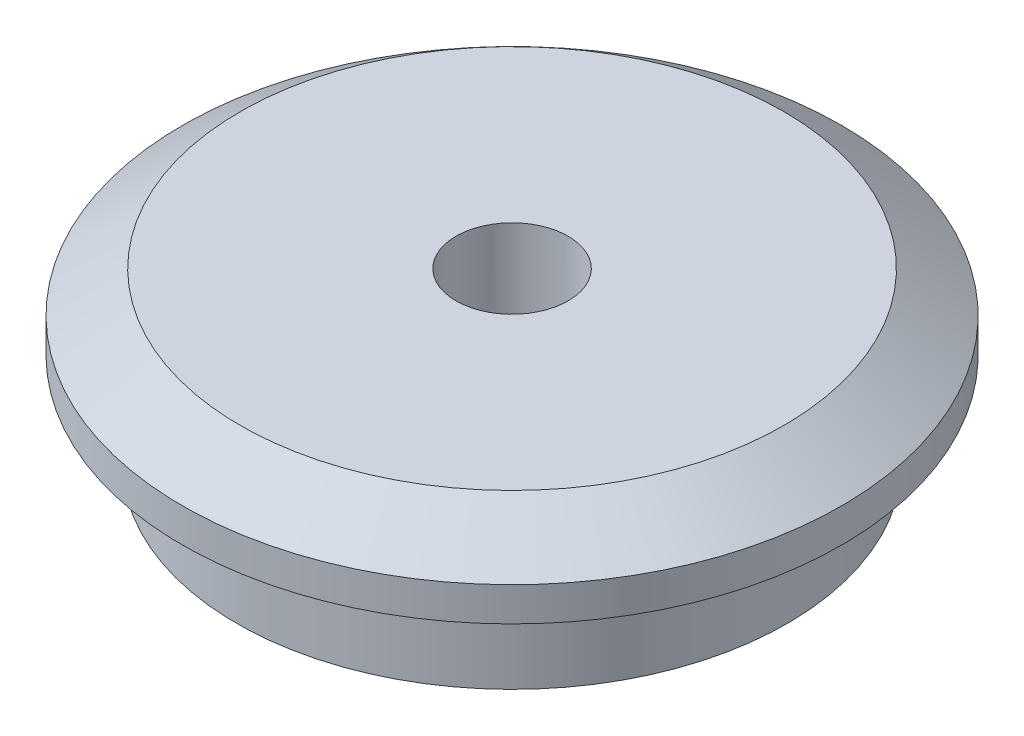
ISO-10303-21;
HEADER;
FILE_DESCRIPTION(('STEP AP214'),'2;1');
FILE_NAME('part.step','',(''),(''),'','','');
FILE_SCHEMA(('AUTOMOTIVE_DESIGN { 1 0 10303 214 1 1 1 1 }'));
ENDSEC;
DATA;
#1=APPLICATION_CONTEXT('core data for automotive mechanical design processes');
#2=APPLICATION_PROTOCOL_DEFINITION('international standard','automotive_design',2000,#1);
#3=PRODUCT_CONTEXT('',#1,'mechanical');
#4=PRODUCT('Part','Part','',(#3));
#5=PRODUCT_RELATED_PRODUCT_CATEGORY('part','',(#4));
#6=PRODUCT_DEFINITION_FORMATION('','',#4);
#7=PRODUCT_DEFINITION_CONTEXT('part definition',#1,'design');
#8=PRODUCT_DEFINITION('design','',#6,#7);
#9=PRODUCT_DEFINITION_SHAPE('','',#8);
#10=(LENGTH_UNIT() NAMED_UNIT(*) SI_UNIT(.MILLI.,.METRE.));
#11=(NAMED_UNIT(*) PLANE_ANGLE_UNIT() SI_UNIT($,.RADIAN.));
#12=(NAMED_UNIT(*) SI_UNIT($,.STERADIAN.) SOLID_ANGLE_UNIT());
#13=UNCERTAINTY_MEASURE_WITH_UNIT(LENGTH_MEASURE(1.E-05),#10,'distance_accuracy_value','');
#14=(GEOMETRIC_REPRESENTATION_CONTEXT(3) GLOBAL_UNCERTAINTY_ASSIGNED_CONTEXT((#13)) GLOBAL_UNIT_ASSIGNED_CONTEXT((#10,
#11,#12)) REPRESENTATION_CONTEXT('',''));
#15=CARTESIAN_POINT('',(0.,0.,0.));
#16=DIRECTION('',(0.,0.,1.));
#17=DIRECTION('',(1.,0.,0.));
#18=AXIS2_PLACEMENT_3D('',#15,#16,#17);
#19=CARTESIAN_POINT('',(0.,2.2,0.));
#20=DIRECTION('',(0.,-1.,0.));
#21=DIRECTION('',(0.,0.,-1.));
#22=AXIS2_PLACEMENT_3D('',#19,#20,#21);
#23=PLANE('',#22);
#24=CARTESIAN_POINT('',(0.,2.2,0.));
#25=DIRECTION('',(0.,-1.,0.));
#26=DIRECTION('',(0.,0.,-1.));
#27=AXIS2_PLACEMENT_3D('',#24,#25,#26);
#28=CIRCLE('',#27,1.65);
#29=CARTESIAN_POINT('',(0.,2.2,-1.65));
#30=VERTEX_POINT('',#29);
#31=EDGE_CURVE('E60',#30,#30,#28,.T.);
#32=ORIENTED_EDGE('',*,*,#31,.F.);
#33=EDGE_LOOP('',(#32));
#34=FACE_BOUND('',#33,.T.);
#35=CARTESIAN_POINT('',(0.,2.2,0.));
#36=DIRECTION('',(0.,-1.,0.));
#37=DIRECTION('',(0.,0.,-1.));
#38=AXIS2_PLACEMENT_3D('',#35,#36,#37);
#39=CIRCLE('',#38,6.9);
#40=CARTESIAN_POINT('',(0.,2.2,-6.9));
#41=VERTEX_POINT('',#40);
#42=EDGE_CURVE('E10',#41,#41,#39,.T.);
#43=ORIENTED_EDGE('',*,*,#42,.T.);
#44=EDGE_LOOP('',(#43));
#45=FACE_BOUND('',#44,.T.);
#46=ADVANCED_FACE('F32',(#34,#45),#23,.T.);
#47=CARTESIAN_POINT('',(0.,0.,0.));
#48=DIRECTION('',(0.,-1.,0.));
#49=DIRECTION('',(0.,0.,-1.));
#50=AXIS2_PLACEMENT_3D('',#47,#48,#49);
#51=CYLINDRICAL_SURFACE('',#50,6.9);
#52=CARTESIAN_POINT('',(0.,0.,0.));
#53=DIRECTION('',(0.,-1.,0.));
#54=DIRECTION('',(0.,0.,-1.));
#55=AXIS2_PLACEMENT_3D('',#52,#53,#54);
#56=CIRCLE('',#55,6.9);
#57=CARTESIAN_POINT('',(0.,0.,-6.9));
#58=VERTEX_POINT('',#57);
#59=EDGE_CURVE('E38',#58,#58,#56,.T.);
#60=ORIENTED_EDGE('',*,*,#59,.T.);
#61=EDGE_LOOP('',(#60));
#62=FACE_BOUND('',#61,.T.);
#63=ORIENTED_EDGE('',*,*,#42,.F.);
#64=EDGE_LOOP('',(#63));
#65=FACE_BOUND('',#64,.T.);
#66=ADVANCED_FACE('F102',(#62,#65),#51,.F.);
#67=CARTESIAN_POINT('',(6.9,0.,0.));
#68=DIRECTION('',(0.,-1.,0.));
#69=DIRECTION('',(0.,0.,-1.));
#70=AXIS2_PLACEMENT_3D('',#67,#68,#69);
#71=PLANE('',#70);
#72=CARTESIAN_POINT('',(0.,0.,0.));
#73=DIRECTION('',(0.,-1.,0.));
#74=DIRECTION('',(0.,0.,-1.));
#75=AXIS2_PLACEMENT_3D('',#72,#73,#74);
#76=CIRCLE('',#75,8.1);
#77=CARTESIAN_POINT('',(0.,0.,-8.1));
#78=VERTEX_POINT('',#77);
#79=EDGE_CURVE('E42',#78,#78,#76,.T.);
#80=ORIENTED_EDGE('',*,*,#79,.T.);
#81=EDGE_LOOP('',(#80));
#82=FACE_BOUND('',#81,.T.);
#83=ORIENTED_EDGE('',*,*,#59,.F.);
#84=EDGE_LOOP('',(#83));
#85=FACE_BOUND('',#84,.T.);
#86=ADVANCED_FACE('F96',(#82,#85),#71,.T.);
#87=CARTESIAN_POINT('',(0.,0.,0.));
#88=DIRECTION('',(0.,-1.,0.));
#89=DIRECTION('',(0.,0.,-1.));
#90=AXIS2_PLACEMENT_3D('',#87,#88,#89);
#91=CYLINDRICAL_SURFACE('',#90,8.1);
#92=CARTESIAN_POINT('',(0.,2.8,0.));
#93=DIRECTION('',(0.,-1.,0.));
#94=DIRECTION('',(0.,0.,-1.));
#95=AXIS2_PLACEMENT_3D('',#92,#93,#94);
#96=CIRCLE('',#95,8.1);
#97=CARTESIAN_POINT('',(0.,2.8,-8.1));
#98=VERTEX_POINT('',#97);
#99=EDGE_CURVE('E46',#98,#98,#96,.T.);
#100=ORIENTED_EDGE('',*,*,#99,.T.);
#101=EDGE_LOOP('',(#100));
#102=FACE_BOUND('',#101,.T.);
#103=ORIENTED_EDGE('',*,*,#79,.F.);
#104=EDGE_LOOP('',(#103));
#105=FACE_BOUND('',#104,.T.);
#106=ADVANCED_FACE('F90',(#102,#105),#91,.T.);
#107=CARTESIAN_POINT('',(8.1,2.8,0.));
#108=DIRECTION('',(0.,-1.,0.));
#109=DIRECTION('',(0.,0.,-1.));
#110=AXIS2_PLACEMENT_3D('',#107,#108,#109);
#111=PLANE('',#110);
#112=CARTESIAN_POINT('',(0.,2.8,0.));
#113=DIRECTION('',(0.,-1.,0.));
#114=DIRECTION('',(0.,0.,-1.));
#115=AXIS2_PLACEMENT_3D('',#112,#113,#114);
#116=CIRCLE('',#115,9.7);
#117=CARTESIAN_POINT('',(0.,2.8,-9.7));
#118=VERTEX_POINT('',#117);
#119=EDGE_CURVE('E51',#118,#118,#116,.T.);
#120=ORIENTED_EDGE('',*,*,#119,.T.);
#121=EDGE_LOOP('',(#120));
#122=FACE_BOUND('',#121,.T.);
#123=ORIENTED_EDGE('',*,*,#99,.F.);
#124=EDGE_LOOP('',(#123));
#125=FACE_BOUND('',#124,.T.);
#126=ADVANCED_FACE('F84',(#122,#125),#111,.T.);
#127=CARTESIAN_POINT('',(0.,0.,0.));
#128=DIRECTION('',(0.,-1.,0.));
#129=DIRECTION('',(0.,0.,-1.));
#130=AXIS2_PLACEMENT_3D('',#127,#128,#129);
#131=CYLINDRICAL_SURFACE('',#130,9.7);
#132=CARTESIAN_POINT('',(0.,3.8,0.));
#133=DIRECTION('',(0.,-1.,0.));
#134=DIRECTION('',(0.,0.,-1.));
#135=AXIS2_PLACEMENT_3D('',#132,#133,#134);
#136=CIRCLE('',#135,9.7);
#137=CARTESIAN_POINT('',(0.,3.8,-9.7));
#138=VERTEX_POINT('',#137);
#139=EDGE_CURVE('E54',#138,#138,#136,.T.);
#140=ORIENTED_EDGE('',*,*,#139,.T.);
#141=EDGE_LOOP('',(#140));
#142=FACE_BOUND('',#141,.T.);
#143=ORIENTED_EDGE('',*,*,#119,.F.);
#144=EDGE_LOOP('',(#143));
#145=FACE_BOUND('',#144,.T.);
#146=ADVANCED_FACE('F78',(#142,#145),#131,.T.);
#147=CARTESIAN_POINT('',(0.,3.8,0.));
#148=DIRECTION('',(0.,-1.,0.));
#149=DIRECTION('',(0.,0.,-1.));
#150=AXIS2_PLACEMENT_3D('',#147,#148,#149);
#151=CONICAL_SURFACE('',#150,9.7,0.95613337487273);
#152=CARTESIAN_POINT('',(0.,5.,0.));
#153=DIRECTION('',(0.,-1.,0.));
#154=DIRECTION('',(0.,0.,-1.));
#155=AXIS2_PLACEMENT_3D('',#152,#153,#154);
#156=CIRCLE('',#155,8.);
#157=CARTESIAN_POINT('',(0.,5.,-8.));
#158=VERTEX_POINT('',#157);
#159=EDGE_CURVE('E57',#158,#158,#156,.T.);
#160=ORIENTED_EDGE('',*,*,#159,.T.);
#161=EDGE_LOOP('',(#160));
#162=FACE_BOUND('',#161,.T.);
#163=ORIENTED_EDGE('',*,*,#139,.F.);
#164=EDGE_LOOP('',(#163));
#165=FACE_BOUND('',#164,.T.);
#166=ADVANCED_FACE('F72',(#162,#165),#151,.T.);
#167=CARTESIAN_POINT('',(8.,5.,0.));
#168=DIRECTION('',(0.,1.,0.));
#169=DIRECTION('',(0.,0.,1.));
#170=AXIS2_PLACEMENT_3D('',#167,#168,#169);
#171=PLANE('',#170);
#172=CARTESIAN_POINT('',(0.,5.,0.));
#173=DIRECTION('',(0.,1.,0.));
#174=DIRECTION('',(0.,0.,1.));
#175=AXIS2_PLACEMENT_3D('',#172,#173,#174);
#176=CIRCLE('',#175,1.65);
#177=CARTESIAN_POINT('',(0.,5.,1.65));
#178=VERTEX_POINT('',#177);
#179=EDGE_CURVE('E63',#178,#178,#176,.T.);
#180=ORIENTED_EDGE('',*,*,#179,.F.);
#181=EDGE_LOOP('',(#180));
#182=FACE_BOUND('',#181,.T.);
#183=ORIENTED_EDGE('',*,*,#159,.F.);
#184=EDGE_LOOP('',(#183));
#185=FACE_BOUND('',#184,.T.);
#186=ADVANCED_FACE('F69',(#182,#185),#171,.T.);
#187=CARTESIAN_POINT('',(0.,-5.,0.));
#188=DIRECTION('',(0.,1.,0.));
#189=DIRECTION('',(0.,0.,1.));
#190=AXIS2_PLACEMENT_3D('',#187,#188,#189);
#191=CYLINDRICAL_SURFACE('',#190,1.65);
#192=ORIENTED_EDGE('',*,*,#31,.T.);
#193=EDGE_LOOP('',(#192));
#194=FACE_BOUND('',#193,.T.);
#195=ORIENTED_EDGE('',*,*,#179,.T.);
#196=EDGE_LOOP('',(#195));
#197=FACE_BOUND('',#196,.T.);
#198=ADVANCED_FACE('F67',(#194,#197),#191,.F.);
#199=CLOSED_SHELL('',(#46,#66,#86,#106,#126,#146,#166,#186,#198));
#200=MANIFOLD_SOLID_BREP('B2',#199);
#201=ADVANCED_BREP_SHAPE_REPRESENTATION('',(#18,#200),#14);
#202=SHAPE_DEFINITION_REPRESENTATION(#9,#201);
ENDSEC;
END-ISO-10303-21;
